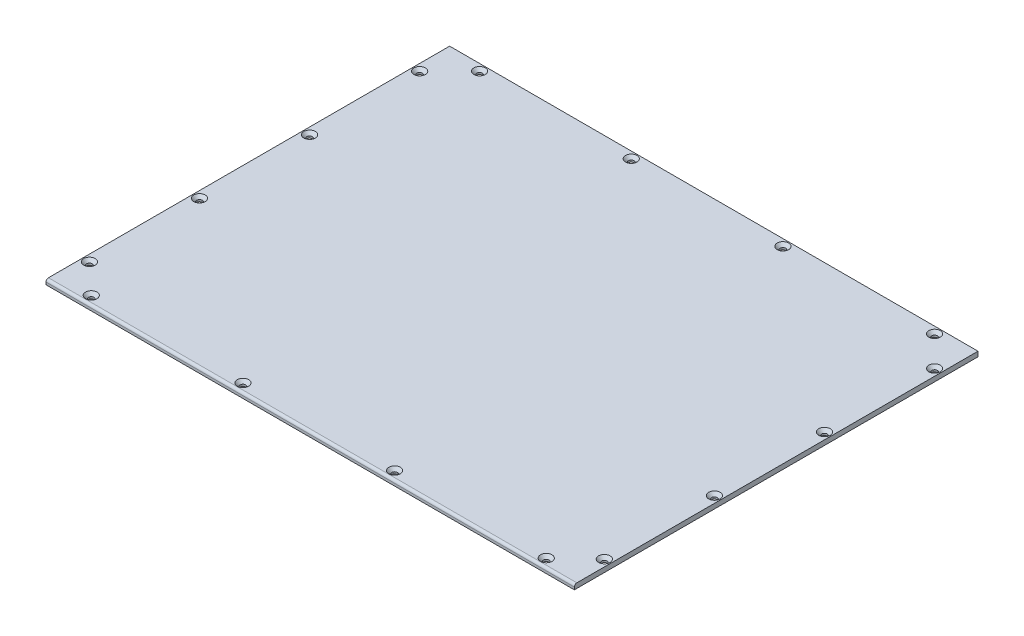
ISO-10303-21;
HEADER;
FILE_DESCRIPTION(('STEP AP214'),'2;1');
FILE_NAME('part.step','',(''),(''),'','','');
FILE_SCHEMA(('AUTOMOTIVE_DESIGN { 1 0 10303 214 1 1 1 1 }'));
ENDSEC;
DATA;
#1=APPLICATION_CONTEXT('core data for automotive mechanical design processes');
#2=APPLICATION_PROTOCOL_DEFINITION('international standard','automotive_design',2000,#1);
#3=PRODUCT_CONTEXT('',#1,'mechanical');
#4=PRODUCT('Part','Part','',(#3));
#5=PRODUCT_RELATED_PRODUCT_CATEGORY('part','',(#4));
#6=PRODUCT_DEFINITION_FORMATION('','',#4);
#7=PRODUCT_DEFINITION_CONTEXT('part definition',#1,'design');
#8=PRODUCT_DEFINITION('design','',#6,#7);
#9=PRODUCT_DEFINITION_SHAPE('','',#8);
#10=(LENGTH_UNIT() NAMED_UNIT(*) SI_UNIT(.MILLI.,.METRE.));
#11=(NAMED_UNIT(*) PLANE_ANGLE_UNIT() SI_UNIT($,.RADIAN.));
#12=(NAMED_UNIT(*) SI_UNIT($,.STERADIAN.) SOLID_ANGLE_UNIT());
#13=UNCERTAINTY_MEASURE_WITH_UNIT(LENGTH_MEASURE(1.E-05),#10,'distance_accuracy_value','');
#14=(GEOMETRIC_REPRESENTATION_CONTEXT(3) GLOBAL_UNCERTAINTY_ASSIGNED_CONTEXT((#13)) GLOBAL_UNIT_ASSIGNED_CONTEXT((#10,
#11,#12)) REPRESENTATION_CONTEXT('',''));
#15=CARTESIAN_POINT('',(0.,0.,0.));
#16=DIRECTION('',(0.,0.,1.));
#17=DIRECTION('',(1.,0.,0.));
#18=AXIS2_PLACEMENT_3D('',#15,#16,#17);
#19=CARTESIAN_POINT('',(0.,0.,0.));
#20=DIRECTION('',(0.,-1.,0.));
#21=DIRECTION('',(0.,0.,-1.));
#22=AXIS2_PLACEMENT_3D('',#19,#20,#21);
#23=PLANE('',#22);
#24=CARTESIAN_POINT('',(30.,0.,-324.5));
#25=DIRECTION('',(0.,1.,0.));
#26=DIRECTION('',(0.,0.,1.));
#27=AXIS2_PLACEMENT_3D('',#24,#25,#26);
#28=CIRCLE('',#27,2.25);
#29=CARTESIAN_POINT('',(30.,0.,-322.25));
#30=VERTEX_POINT('',#29);
#31=EDGE_CURVE('E261',#30,#30,#28,.T.);
#32=ORIENTED_EDGE('',*,*,#31,.T.);
#33=EDGE_LOOP('',(#32));
#34=FACE_BOUND('',#33,.T.);
#35=CARTESIAN_POINT('',(154.,0.,-324.5));
#36=DIRECTION('',(0.,1.,0.));
#37=DIRECTION('',(0.,0.,1.));
#38=AXIS2_PLACEMENT_3D('',#35,#36,#37);
#39=CIRCLE('',#38,2.25);
#40=CARTESIAN_POINT('',(154.,0.,-322.25));
#41=VERTEX_POINT('',#40);
#42=EDGE_CURVE('E252',#41,#41,#39,.T.);
#43=ORIENTED_EDGE('',*,*,#42,.T.);
#44=EDGE_LOOP('',(#43));
#45=FACE_BOUND('',#44,.T.);
#46=DIRECTION('',(0.,0.,1.));
#47=VECTOR('',#46,1.);
#48=CARTESIAN_POINT('',(0.,0.,0.));
#49=LINE('',#48,#47);
#50=CARTESIAN_POINT('',(0.,0.,-330.));
#51=VERTEX_POINT('',#50);
#52=CARTESIAN_POINT('',(0.,0.,0.));
#53=VERTEX_POINT('',#52);
#54=EDGE_CURVE('E104',#51,#53,#49,.T.);
#55=ORIENTED_EDGE('',*,*,#54,.F.);
#56=DIRECTION('',(-1.,0.,0.));
#57=VECTOR('',#56,1.);
#58=CARTESIAN_POINT('',(0.,0.,-330.));
#59=LINE('',#58,#57);
#60=CARTESIAN_POINT('',(432.,0.,-330.));
#61=VERTEX_POINT('',#60);
#62=EDGE_CURVE('E112',#61,#51,#59,.T.);
#63=ORIENTED_EDGE('',*,*,#62,.F.);
#64=DIRECTION('',(0.,0.,-1.));
#65=VECTOR('',#64,1.);
#66=CARTESIAN_POINT('',(432.,0.,0.));
#67=LINE('',#66,#65);
#68=CARTESIAN_POINT('',(432.,0.,0.));
#69=VERTEX_POINT('',#68);
#70=EDGE_CURVE('E91',#69,#61,#67,.T.);
#71=ORIENTED_EDGE('',*,*,#70,.F.);
#72=DIRECTION('',(1.,0.,0.));
#73=VECTOR('',#72,1.);
#74=CARTESIAN_POINT('',(0.,0.,0.));
#75=LINE('',#74,#73);
#76=EDGE_CURVE('E107',#53,#69,#75,.T.);
#77=ORIENTED_EDGE('',*,*,#76,.F.);
#78=EDGE_LOOP('',(#55,#63,#71,#77));
#79=FACE_BOUND('',#78,.T.);
#80=CARTESIAN_POINT('',(5.5,0.,-300.));
#81=DIRECTION('',(0.,1.,0.));
#82=DIRECTION('',(0.,0.,1.));
#83=AXIS2_PLACEMENT_3D('',#80,#81,#82);
#84=CIRCLE('',#83,2.25);
#85=CARTESIAN_POINT('',(5.5,0.,-297.75));
#86=VERTEX_POINT('',#85);
#87=EDGE_CURVE('E108',#86,#86,#84,.T.);
#88=ORIENTED_EDGE('',*,*,#87,.T.);
#89=EDGE_LOOP('',(#88));
#90=FACE_BOUND('',#89,.T.);
#91=CARTESIAN_POINT('',(5.5,0.,-210.));
#92=DIRECTION('',(0.,1.,0.));
#93=DIRECTION('',(0.,0.,1.));
#94=AXIS2_PLACEMENT_3D('',#91,#92,#93);
#95=CIRCLE('',#94,2.25);
#96=CARTESIAN_POINT('',(5.5,0.,-207.75));
#97=VERTEX_POINT('',#96);
#98=EDGE_CURVE('E135',#97,#97,#95,.T.);
#99=ORIENTED_EDGE('',*,*,#98,.T.);
#100=EDGE_LOOP('',(#99));
#101=FACE_BOUND('',#100,.T.);
#102=CARTESIAN_POINT('',(5.5,0.,-120.));
#103=DIRECTION('',(0.,1.,0.));
#104=DIRECTION('',(0.,0.,1.));
#105=AXIS2_PLACEMENT_3D('',#102,#103,#104);
#106=CIRCLE('',#105,2.25);
#107=CARTESIAN_POINT('',(5.5,0.,-117.75));
#108=VERTEX_POINT('',#107);
#109=EDGE_CURVE('E144',#108,#108,#106,.T.);
#110=ORIENTED_EDGE('',*,*,#109,.T.);
#111=EDGE_LOOP('',(#110));
#112=FACE_BOUND('',#111,.T.);
#113=CARTESIAN_POINT('',(5.5,0.,-30.0000000000001));
#114=DIRECTION('',(0.,1.,0.));
#115=DIRECTION('',(0.,0.,1.));
#116=AXIS2_PLACEMENT_3D('',#113,#114,#115);
#117=CIRCLE('',#116,2.25);
#118=CARTESIAN_POINT('',(5.5,0.,-27.7500000000001));
#119=VERTEX_POINT('',#118);
#120=EDGE_CURVE('E153',#119,#119,#117,.T.);
#121=ORIENTED_EDGE('',*,*,#120,.T.);
#122=EDGE_LOOP('',(#121));
#123=FACE_BOUND('',#122,.T.);
#124=CARTESIAN_POINT('',(30.,0.,-7.));
#125=DIRECTION('',(0.,1.,0.));
#126=DIRECTION('',(0.,0.,1.));
#127=AXIS2_PLACEMENT_3D('',#124,#125,#126);
#128=CIRCLE('',#127,2.25);
#129=CARTESIAN_POINT('',(30.,0.,-4.75));
#130=VERTEX_POINT('',#129);
#131=EDGE_CURVE('E162',#130,#130,#128,.T.);
#132=ORIENTED_EDGE('',*,*,#131,.T.);
#133=EDGE_LOOP('',(#132));
#134=FACE_BOUND('',#133,.T.);
#135=CARTESIAN_POINT('',(154.,0.,-7.));
#136=DIRECTION('',(0.,1.,0.));
#137=DIRECTION('',(0.,0.,1.));
#138=AXIS2_PLACEMENT_3D('',#135,#136,#137);
#139=CIRCLE('',#138,2.25);
#140=CARTESIAN_POINT('',(154.,0.,-4.75));
#141=VERTEX_POINT('',#140);
#142=EDGE_CURVE('E171',#141,#141,#139,.T.);
#143=ORIENTED_EDGE('',*,*,#142,.T.);
#144=EDGE_LOOP('',(#143));
#145=FACE_BOUND('',#144,.T.);
#146=CARTESIAN_POINT('',(278.,0.,-7.));
#147=DIRECTION('',(0.,1.,0.));
#148=DIRECTION('',(0.,0.,1.));
#149=AXIS2_PLACEMENT_3D('',#146,#147,#148);
#150=CIRCLE('',#149,2.24999999999997);
#151=CARTESIAN_POINT('',(278.,0.,-4.75000000000003));
#152=VERTEX_POINT('',#151);
#153=EDGE_CURVE('E180',#152,#152,#150,.T.);
#154=ORIENTED_EDGE('',*,*,#153,.T.);
#155=EDGE_LOOP('',(#154));
#156=FACE_BOUND('',#155,.T.);
#157=CARTESIAN_POINT('',(402.,0.,-7.));
#158=DIRECTION('',(0.,1.,0.));
#159=DIRECTION('',(0.,0.,1.));
#160=AXIS2_PLACEMENT_3D('',#157,#158,#159);
#161=CIRCLE('',#160,2.24999999999997);
#162=CARTESIAN_POINT('',(402.,0.,-4.75000000000003));
#163=VERTEX_POINT('',#162);
#164=EDGE_CURVE('E189',#163,#163,#161,.T.);
#165=ORIENTED_EDGE('',*,*,#164,.T.);
#166=EDGE_LOOP('',(#165));
#167=FACE_BOUND('',#166,.T.);
#168=CARTESIAN_POINT('',(426.5,0.,-30.0000000000001));
#169=DIRECTION('',(0.,1.,0.));
#170=DIRECTION('',(0.,0.,1.));
#171=AXIS2_PLACEMENT_3D('',#168,#169,#170);
#172=CIRCLE('',#171,2.24999999999997);
#173=CARTESIAN_POINT('',(426.5,0.,-27.7500000000001));
#174=VERTEX_POINT('',#173);
#175=EDGE_CURVE('E198',#174,#174,#172,.T.);
#176=ORIENTED_EDGE('',*,*,#175,.T.);
#177=EDGE_LOOP('',(#176));
#178=FACE_BOUND('',#177,.T.);
#179=CARTESIAN_POINT('',(426.5,0.,-120.));
#180=DIRECTION('',(0.,1.,0.));
#181=DIRECTION('',(0.,0.,1.));
#182=AXIS2_PLACEMENT_3D('',#179,#180,#181);
#183=CIRCLE('',#182,2.24999999999997);
#184=CARTESIAN_POINT('',(426.5,0.,-117.75));
#185=VERTEX_POINT('',#184);
#186=EDGE_CURVE('E207',#185,#185,#183,.T.);
#187=ORIENTED_EDGE('',*,*,#186,.T.);
#188=EDGE_LOOP('',(#187));
#189=FACE_BOUND('',#188,.T.);
#190=CARTESIAN_POINT('',(426.5,0.,-210.));
#191=DIRECTION('',(0.,1.,0.));
#192=DIRECTION('',(0.,0.,1.));
#193=AXIS2_PLACEMENT_3D('',#190,#191,#192);
#194=CIRCLE('',#193,2.24999999999997);
#195=CARTESIAN_POINT('',(426.5,0.,-207.75));
#196=VERTEX_POINT('',#195);
#197=EDGE_CURVE('E216',#196,#196,#194,.T.);
#198=ORIENTED_EDGE('',*,*,#197,.T.);
#199=EDGE_LOOP('',(#198));
#200=FACE_BOUND('',#199,.T.);
#201=CARTESIAN_POINT('',(426.5,0.,-300.));
#202=DIRECTION('',(0.,1.,0.));
#203=DIRECTION('',(0.,0.,1.));
#204=AXIS2_PLACEMENT_3D('',#201,#202,#203);
#205=CIRCLE('',#204,2.24999999999997);
#206=CARTESIAN_POINT('',(426.5,0.,-297.75));
#207=VERTEX_POINT('',#206);
#208=EDGE_CURVE('E225',#207,#207,#205,.T.);
#209=ORIENTED_EDGE('',*,*,#208,.T.);
#210=EDGE_LOOP('',(#209));
#211=FACE_BOUND('',#210,.T.);
#212=CARTESIAN_POINT('',(402.,0.,-324.5));
#213=DIRECTION('',(0.,1.,0.));
#214=DIRECTION('',(0.,0.,1.));
#215=AXIS2_PLACEMENT_3D('',#212,#213,#214);
#216=CIRCLE('',#215,2.24999999999997);
#217=CARTESIAN_POINT('',(402.,0.,-322.25));
#218=VERTEX_POINT('',#217);
#219=EDGE_CURVE('E234',#218,#218,#216,.T.);
#220=ORIENTED_EDGE('',*,*,#219,.T.);
#221=EDGE_LOOP('',(#220));
#222=FACE_BOUND('',#221,.T.);
#223=CARTESIAN_POINT('',(278.,0.,-324.5));
#224=DIRECTION('',(0.,1.,0.));
#225=DIRECTION('',(0.,0.,1.));
#226=AXIS2_PLACEMENT_3D('',#223,#224,#225);
#227=CIRCLE('',#226,2.24999999999997);
#228=CARTESIAN_POINT('',(278.,0.,-322.25));
#229=VERTEX_POINT('',#228);
#230=EDGE_CURVE('E243',#229,#229,#227,.T.);
#231=ORIENTED_EDGE('',*,*,#230,.T.);
#232=EDGE_LOOP('',(#231));
#233=FACE_BOUND('',#232,.T.);
#234=ADVANCED_FACE('F32',(#34,#45,#79,#90,#101,#112,#123,#134,#145,#156,#167,#178,#189,#200,
#211,#222,#233),#23,.T.);
#235=CARTESIAN_POINT('',(0.,4.,0.));
#236=DIRECTION('',(1.,0.,0.));
#237=DIRECTION('',(0.,0.,-1.));
#238=AXIS2_PLACEMENT_3D('',#235,#236,#237);
#239=PLANE('',#238);
#240=DIRECTION('',(0.,-1.,0.));
#241=VECTOR('',#240,1.);
#242=CARTESIAN_POINT('',(0.,4.,0.));
#243=LINE('',#242,#241);
#244=CARTESIAN_POINT('',(0.,2.,0.));
#245=VERTEX_POINT('',#244);
#246=EDGE_CURVE('E115',#245,#53,#243,.T.);
#247=ORIENTED_EDGE('',*,*,#246,.F.);
#248=CARTESIAN_POINT('',(0.,2.,-2.));
#249=DIRECTION('',(1.,0.,0.));
#250=DIRECTION('',(0.,0.,-1.));
#251=AXIS2_PLACEMENT_3D('',#248,#249,#250);
#252=CIRCLE('',#251,2.);
#253=CARTESIAN_POINT('',(0.,4.,-2.));
#254=VERTEX_POINT('',#253);
#255=EDGE_CURVE('E11',#245,#254,#252,.F.);
#256=ORIENTED_EDGE('',*,*,#255,.T.);
#257=DIRECTION('',(0.,0.,1.));
#258=VECTOR('',#257,1.);
#259=CARTESIAN_POINT('',(0.,4.,0.));
#260=LINE('',#259,#258);
#261=CARTESIAN_POINT('',(0.,4.,-330.));
#262=VERTEX_POINT('',#261);
#263=EDGE_CURVE('E85',#262,#254,#260,.T.);
#264=ORIENTED_EDGE('',*,*,#263,.F.);
#265=DIRECTION('',(0.,-1.,0.));
#266=VECTOR('',#265,1.);
#267=CARTESIAN_POINT('',(0.,4.,-330.));
#268=LINE('',#267,#266);
#269=EDGE_CURVE('E95',#262,#51,#268,.T.);
#270=ORIENTED_EDGE('',*,*,#269,.T.);
#271=ORIENTED_EDGE('',*,*,#54,.T.);
#272=EDGE_LOOP('',(#247,#256,#264,#270,#271));
#273=FACE_BOUND('',#272,.T.);
#274=ADVANCED_FACE('F125',(#273),#239,.F.);
#275=CARTESIAN_POINT('',(0.,4.,0.));
#276=DIRECTION('',(0.,0.,-1.));
#277=DIRECTION('',(-1.,0.,0.));
#278=AXIS2_PLACEMENT_3D('',#275,#276,#277);
#279=PLANE('',#278);
#280=DIRECTION('',(0.,-1.,0.));
#281=VECTOR('',#280,1.);
#282=CARTESIAN_POINT('',(432.,4.,0.));
#283=LINE('',#282,#281);
#284=CARTESIAN_POINT('',(432.,2.,0.));
#285=VERTEX_POINT('',#284);
#286=EDGE_CURVE('E94',#285,#69,#283,.T.);
#287=ORIENTED_EDGE('',*,*,#286,.F.);
#288=DIRECTION('',(1.,0.,0.));
#289=VECTOR('',#288,1.);
#290=CARTESIAN_POINT('',(0.,2.,0.));
#291=LINE('',#290,#289);
#292=EDGE_CURVE('E40',#285,#245,#291,.F.);
#293=ORIENTED_EDGE('',*,*,#292,.T.);
#294=ORIENTED_EDGE('',*,*,#246,.T.);
#295=ORIENTED_EDGE('',*,*,#76,.T.);
#296=EDGE_LOOP('',(#287,#293,#294,#295));
#297=FACE_BOUND('',#296,.T.);
#298=ADVANCED_FACE('F119',(#297),#279,.F.);
#299=CARTESIAN_POINT('',(432.,4.,0.));
#300=DIRECTION('',(-1.,0.,0.));
#301=DIRECTION('',(0.,0.,1.));
#302=AXIS2_PLACEMENT_3D('',#299,#300,#301);
#303=PLANE('',#302);
#304=DIRECTION('',(0.,0.,-1.));
#305=VECTOR('',#304,1.);
#306=CARTESIAN_POINT('',(432.,4.,0.));
#307=LINE('',#306,#305);
#308=CARTESIAN_POINT('',(432.,4.,-2.));
#309=VERTEX_POINT('',#308);
#310=CARTESIAN_POINT('',(432.,4.,-330.));
#311=VERTEX_POINT('',#310);
#312=EDGE_CURVE('E76',#309,#311,#307,.T.);
#313=ORIENTED_EDGE('',*,*,#312,.F.);
#314=CARTESIAN_POINT('',(432.,2.,-2.));
#315=DIRECTION('',(-1.,0.,0.));
#316=DIRECTION('',(0.,0.,1.));
#317=AXIS2_PLACEMENT_3D('',#314,#315,#316);
#318=CIRCLE('',#317,2.);
#319=EDGE_CURVE('E54',#309,#285,#318,.F.);
#320=ORIENTED_EDGE('',*,*,#319,.T.);
#321=ORIENTED_EDGE('',*,*,#286,.T.);
#322=ORIENTED_EDGE('',*,*,#70,.T.);
#323=DIRECTION('',(0.,-1.,0.));
#324=VECTOR('',#323,1.);
#325=CARTESIAN_POINT('',(432.,4.,-330.));
#326=LINE('',#325,#324);
#327=EDGE_CURVE('E88',#311,#61,#326,.T.);
#328=ORIENTED_EDGE('',*,*,#327,.F.);
#329=EDGE_LOOP('',(#313,#320,#321,#322,#328));
#330=FACE_BOUND('',#329,.T.);
#331=ADVANCED_FACE('F89',(#330),#303,.F.);
#332=CARTESIAN_POINT('',(0.,4.,-330.));
#333=DIRECTION('',(0.,0.,1.));
#334=DIRECTION('',(1.,0.,0.));
#335=AXIS2_PLACEMENT_3D('',#332,#333,#334);
#336=PLANE('',#335);
#337=ORIENTED_EDGE('',*,*,#62,.T.);
#338=ORIENTED_EDGE('',*,*,#269,.F.);
#339=DIRECTION('',(-1.,0.,0.));
#340=VECTOR('',#339,1.);
#341=CARTESIAN_POINT('',(0.,4.,-330.));
#342=LINE('',#341,#340);
#343=EDGE_CURVE('E81',#311,#262,#342,.T.);
#344=ORIENTED_EDGE('',*,*,#343,.F.);
#345=ORIENTED_EDGE('',*,*,#327,.T.);
#346=EDGE_LOOP('',(#337,#338,#344,#345));
#347=FACE_BOUND('',#346,.T.);
#348=ADVANCED_FACE('F97',(#347),#336,.F.);
#349=CARTESIAN_POINT('',(0.,4.,0.));
#350=DIRECTION('',(0.,-1.,0.));
#351=DIRECTION('',(0.,0.,-1.));
#352=AXIS2_PLACEMENT_3D('',#349,#350,#351);
#353=PLANE('',#352);
#354=CARTESIAN_POINT('',(30.,4.,-324.5));
#355=DIRECTION('',(0.,1.,0.));
#356=DIRECTION('',(0.,0.,1.));
#357=AXIS2_PLACEMENT_3D('',#354,#355,#356);
#358=CIRCLE('',#357,4.7);
#359=CARTESIAN_POINT('',(30.,4.,-319.8));
#360=VERTEX_POINT('',#359);
#361=EDGE_CURVE('E267',#360,#360,#358,.T.);
#362=ORIENTED_EDGE('',*,*,#361,.F.);
#363=EDGE_LOOP('',(#362));
#364=FACE_BOUND('',#363,.T.);
#365=CARTESIAN_POINT('',(154.,4.,-324.5));
#366=DIRECTION('',(0.,1.,0.));
#367=DIRECTION('',(0.,0.,1.));
#368=AXIS2_PLACEMENT_3D('',#365,#366,#367);
#369=CIRCLE('',#368,4.70000000000001);
#370=CARTESIAN_POINT('',(154.,4.,-319.8));
#371=VERTEX_POINT('',#370);
#372=EDGE_CURVE('E258',#371,#371,#369,.T.);
#373=ORIENTED_EDGE('',*,*,#372,.F.);
#374=EDGE_LOOP('',(#373));
#375=FACE_BOUND('',#374,.T.);
#376=CARTESIAN_POINT('',(278.,4.,-324.5));
#377=DIRECTION('',(0.,1.,0.));
#378=DIRECTION('',(0.,0.,1.));
#379=AXIS2_PLACEMENT_3D('',#376,#377,#378);
#380=CIRCLE('',#379,4.69999999999998);
#381=CARTESIAN_POINT('',(278.,4.,-319.8));
#382=VERTEX_POINT('',#381);
#383=EDGE_CURVE('E249',#382,#382,#380,.T.);
#384=ORIENTED_EDGE('',*,*,#383,.F.);
#385=EDGE_LOOP('',(#384));
#386=FACE_BOUND('',#385,.T.);
#387=CARTESIAN_POINT('',(402.,4.,-324.5));
#388=DIRECTION('',(0.,1.,0.));
#389=DIRECTION('',(0.,0.,1.));
#390=AXIS2_PLACEMENT_3D('',#387,#388,#389);
#391=CIRCLE('',#390,4.69999999999998);
#392=CARTESIAN_POINT('',(402.,4.,-319.8));
#393=VERTEX_POINT('',#392);
#394=EDGE_CURVE('E240',#393,#393,#391,.T.);
#395=ORIENTED_EDGE('',*,*,#394,.F.);
#396=EDGE_LOOP('',(#395));
#397=FACE_BOUND('',#396,.T.);
#398=CARTESIAN_POINT('',(426.5,4.,-300.));
#399=DIRECTION('',(0.,1.,0.));
#400=DIRECTION('',(0.,0.,1.));
#401=AXIS2_PLACEMENT_3D('',#398,#399,#400);
#402=CIRCLE('',#401,4.69999999999998);
#403=CARTESIAN_POINT('',(426.5,4.,-295.3));
#404=VERTEX_POINT('',#403);
#405=EDGE_CURVE('E231',#404,#404,#402,.T.);
#406=ORIENTED_EDGE('',*,*,#405,.F.);
#407=EDGE_LOOP('',(#406));
#408=FACE_BOUND('',#407,.T.);
#409=CARTESIAN_POINT('',(426.5,4.,-210.));
#410=DIRECTION('',(0.,1.,0.));
#411=DIRECTION('',(0.,0.,1.));
#412=AXIS2_PLACEMENT_3D('',#409,#410,#411);
#413=CIRCLE('',#412,4.69999999999998);
#414=CARTESIAN_POINT('',(426.5,4.,-205.3));
#415=VERTEX_POINT('',#414);
#416=EDGE_CURVE('E222',#415,#415,#413,.T.);
#417=ORIENTED_EDGE('',*,*,#416,.F.);
#418=EDGE_LOOP('',(#417));
#419=FACE_BOUND('',#418,.T.);
#420=CARTESIAN_POINT('',(426.5,4.,-120.));
#421=DIRECTION('',(0.,1.,0.));
#422=DIRECTION('',(0.,0.,1.));
#423=AXIS2_PLACEMENT_3D('',#420,#421,#422);
#424=CIRCLE('',#423,4.69999999999998);
#425=CARTESIAN_POINT('',(426.5,4.,-115.3));
#426=VERTEX_POINT('',#425);
#427=EDGE_CURVE('E213',#426,#426,#424,.T.);
#428=ORIENTED_EDGE('',*,*,#427,.F.);
#429=EDGE_LOOP('',(#428));
#430=FACE_BOUND('',#429,.T.);
#431=CARTESIAN_POINT('',(426.5,4.,-30.0000000000001));
#432=DIRECTION('',(0.,1.,0.));
#433=DIRECTION('',(0.,0.,1.));
#434=AXIS2_PLACEMENT_3D('',#431,#432,#433);
#435=CIRCLE('',#434,4.69999999999998);
#436=CARTESIAN_POINT('',(426.5,4.,-25.3000000000001));
#437=VERTEX_POINT('',#436);
#438=EDGE_CURVE('E204',#437,#437,#435,.T.);
#439=ORIENTED_EDGE('',*,*,#438,.F.);
#440=EDGE_LOOP('',(#439));
#441=FACE_BOUND('',#440,.T.);
#442=CARTESIAN_POINT('',(402.,4.,-7.));
#443=DIRECTION('',(0.,1.,0.));
#444=DIRECTION('',(0.,0.,1.));
#445=AXIS2_PLACEMENT_3D('',#442,#443,#444);
#446=CIRCLE('',#445,4.69999999999998);
#447=CARTESIAN_POINT('',(402.,4.,-2.30000000000002));
#448=VERTEX_POINT('',#447);
#449=EDGE_CURVE('E195',#448,#448,#446,.T.);
#450=ORIENTED_EDGE('',*,*,#449,.F.);
#451=EDGE_LOOP('',(#450));
#452=FACE_BOUND('',#451,.T.);
#453=CARTESIAN_POINT('',(278.,4.,-7.));
#454=DIRECTION('',(0.,1.,0.));
#455=DIRECTION('',(0.,0.,1.));
#456=AXIS2_PLACEMENT_3D('',#453,#454,#455);
#457=CIRCLE('',#456,4.69999999999998);
#458=CARTESIAN_POINT('',(278.,4.,-2.30000000000002));
#459=VERTEX_POINT('',#458);
#460=EDGE_CURVE('E186',#459,#459,#457,.T.);
#461=ORIENTED_EDGE('',*,*,#460,.F.);
#462=EDGE_LOOP('',(#461));
#463=FACE_BOUND('',#462,.T.);
#464=CARTESIAN_POINT('',(154.,4.,-7.));
#465=DIRECTION('',(0.,1.,0.));
#466=DIRECTION('',(0.,0.,1.));
#467=AXIS2_PLACEMENT_3D('',#464,#465,#466);
#468=CIRCLE('',#467,4.70000000000001);
#469=CARTESIAN_POINT('',(154.,4.,-2.29999999999999));
#470=VERTEX_POINT('',#469);
#471=EDGE_CURVE('E177',#470,#470,#468,.T.);
#472=ORIENTED_EDGE('',*,*,#471,.F.);
#473=EDGE_LOOP('',(#472));
#474=FACE_BOUND('',#473,.T.);
#475=CARTESIAN_POINT('',(30.,4.,-7.));
#476=DIRECTION('',(0.,1.,0.));
#477=DIRECTION('',(0.,0.,1.));
#478=AXIS2_PLACEMENT_3D('',#475,#476,#477);
#479=CIRCLE('',#478,4.7);
#480=CARTESIAN_POINT('',(30.,4.,-2.3));
#481=VERTEX_POINT('',#480);
#482=EDGE_CURVE('E168',#481,#481,#479,.T.);
#483=ORIENTED_EDGE('',*,*,#482,.F.);
#484=EDGE_LOOP('',(#483));
#485=FACE_BOUND('',#484,.T.);
#486=CARTESIAN_POINT('',(5.5,4.,-30.0000000000001));
#487=DIRECTION('',(0.,1.,0.));
#488=DIRECTION('',(0.,0.,1.));
#489=AXIS2_PLACEMENT_3D('',#486,#487,#488);
#490=CIRCLE('',#489,4.7);
#491=CARTESIAN_POINT('',(5.5,4.,-25.3000000000001));
#492=VERTEX_POINT('',#491);
#493=EDGE_CURVE('E159',#492,#492,#490,.T.);
#494=ORIENTED_EDGE('',*,*,#493,.F.);
#495=EDGE_LOOP('',(#494));
#496=FACE_BOUND('',#495,.T.);
#497=CARTESIAN_POINT('',(5.5,4.,-120.));
#498=DIRECTION('',(0.,1.,0.));
#499=DIRECTION('',(0.,0.,1.));
#500=AXIS2_PLACEMENT_3D('',#497,#498,#499);
#501=CIRCLE('',#500,4.7);
#502=CARTESIAN_POINT('',(5.5,4.,-115.3));
#503=VERTEX_POINT('',#502);
#504=EDGE_CURVE('E150',#503,#503,#501,.T.);
#505=ORIENTED_EDGE('',*,*,#504,.F.);
#506=EDGE_LOOP('',(#505));
#507=FACE_BOUND('',#506,.T.);
#508=CARTESIAN_POINT('',(5.5,4.,-210.));
#509=DIRECTION('',(0.,1.,0.));
#510=DIRECTION('',(0.,0.,1.));
#511=AXIS2_PLACEMENT_3D('',#508,#509,#510);
#512=CIRCLE('',#511,4.7);
#513=CARTESIAN_POINT('',(5.5,4.,-205.3));
#514=VERTEX_POINT('',#513);
#515=EDGE_CURVE('E141',#514,#514,#512,.T.);
#516=ORIENTED_EDGE('',*,*,#515,.F.);
#517=EDGE_LOOP('',(#516));
#518=FACE_BOUND('',#517,.T.);
#519=CARTESIAN_POINT('',(5.5,4.,-300.));
#520=DIRECTION('',(0.,1.,0.));
#521=DIRECTION('',(0.,0.,1.));
#522=AXIS2_PLACEMENT_3D('',#519,#520,#521);
#523=CIRCLE('',#522,4.7);
#524=CARTESIAN_POINT('',(5.5,4.,-295.3));
#525=VERTEX_POINT('',#524);
#526=EDGE_CURVE('E132',#525,#525,#523,.T.);
#527=ORIENTED_EDGE('',*,*,#526,.F.);
#528=EDGE_LOOP('',(#527));
#529=FACE_BOUND('',#528,.T.);
#530=ORIENTED_EDGE('',*,*,#263,.T.);
#531=DIRECTION('',(1.,0.,0.));
#532=VECTOR('',#531,1.);
#533=CARTESIAN_POINT('',(0.,4.,-2.));
#534=LINE('',#533,#532);
#535=EDGE_CURVE('E84',#254,#309,#534,.T.);
#536=ORIENTED_EDGE('',*,*,#535,.T.);
#537=ORIENTED_EDGE('',*,*,#312,.T.);
#538=ORIENTED_EDGE('',*,*,#343,.T.);
#539=EDGE_LOOP('',(#530,#536,#537,#538));
#540=FACE_BOUND('',#539,.T.);
#541=ADVANCED_FACE('F79',(#364,#375,#386,#397,#408,#419,#430,#441,#452,#463,#474,#485,#496,#507,
#518,#529,#540),#353,.F.);
#542=CARTESIAN_POINT('',(0.,2.,-2.));
#543=DIRECTION('',(1.,0.,0.));
#544=DIRECTION('',(0.,0.,-1.));
#545=AXIS2_PLACEMENT_3D('',#542,#543,#544);
#546=CYLINDRICAL_SURFACE('',#545,2.);
#547=ORIENTED_EDGE('',*,*,#255,.F.);
#548=ORIENTED_EDGE('',*,*,#292,.F.);
#549=ORIENTED_EDGE('',*,*,#319,.F.);
#550=ORIENTED_EDGE('',*,*,#535,.F.);
#551=EDGE_LOOP('',(#547,#548,#549,#550));
#552=FACE_BOUND('',#551,.T.);
#553=ADVANCED_FACE('F34',(#552),#546,.T.);
#554=CARTESIAN_POINT('',(5.5,4.,-300.));
#555=DIRECTION('',(0.,1.,0.));
#556=DIRECTION('',(0.,0.,1.));
#557=AXIS2_PLACEMENT_3D('',#554,#555,#556);
#558=CYLINDRICAL_SURFACE('',#557,2.25);
#559=ORIENTED_EDGE('',*,*,#87,.F.);
#560=EDGE_LOOP('',(#559));
#561=FACE_BOUND('',#560,.T.);
#562=CARTESIAN_POINT('',(5.5,1.55,-300.));
#563=DIRECTION('',(0.,1.,0.));
#564=DIRECTION('',(0.,0.,1.));
#565=AXIS2_PLACEMENT_3D('',#562,#563,#564);
#566=CIRCLE('',#565,2.25);
#567=CARTESIAN_POINT('',(5.5,1.55,-297.75));
#568=VERTEX_POINT('',#567);
#569=EDGE_CURVE('E129',#568,#568,#566,.T.);
#570=ORIENTED_EDGE('',*,*,#569,.T.);
#571=EDGE_LOOP('',(#570));
#572=FACE_BOUND('',#571,.T.);
#573=ADVANCED_FACE('F309',(#561,#572),#558,.F.);
#574=CARTESIAN_POINT('',(5.5,4.,-300.));
#575=DIRECTION('',(0.,1.,0.));
#576=DIRECTION('',(0.,0.,1.));
#577=AXIS2_PLACEMENT_3D('',#574,#575,#576);
#578=CONICAL_SURFACE('',#577,4.7,0.785398163397449);
#579=ORIENTED_EDGE('',*,*,#569,.F.);
#580=EDGE_LOOP('',(#579));
#581=FACE_BOUND('',#580,.T.);
#582=ORIENTED_EDGE('',*,*,#526,.T.);
#583=EDGE_LOOP('',(#582));
#584=FACE_BOUND('',#583,.T.);
#585=ADVANCED_FACE('F306',(#581,#584),#578,.F.);
#586=CARTESIAN_POINT('',(5.5,4.,-210.));
#587=DIRECTION('',(0.,1.,0.));
#588=DIRECTION('',(0.,0.,1.));
#589=AXIS2_PLACEMENT_3D('',#586,#587,#588);
#590=CYLINDRICAL_SURFACE('',#589,2.25);
#591=ORIENTED_EDGE('',*,*,#98,.F.);
#592=EDGE_LOOP('',(#591));
#593=FACE_BOUND('',#592,.T.);
#594=CARTESIAN_POINT('',(5.5,1.55,-210.));
#595=DIRECTION('',(0.,1.,0.));
#596=DIRECTION('',(0.,0.,1.));
#597=AXIS2_PLACEMENT_3D('',#594,#595,#596);
#598=CIRCLE('',#597,2.25);
#599=CARTESIAN_POINT('',(5.5,1.55,-207.75));
#600=VERTEX_POINT('',#599);
#601=EDGE_CURVE('E138',#600,#600,#598,.T.);
#602=ORIENTED_EDGE('',*,*,#601,.T.);
#603=EDGE_LOOP('',(#602));
#604=FACE_BOUND('',#603,.T.);
#605=ADVANCED_FACE('F308',(#593,#604),#590,.F.);
#606=CARTESIAN_POINT('',(5.5,4.,-210.));
#607=DIRECTION('',(0.,1.,0.));
#608=DIRECTION('',(0.,0.,1.));
#609=AXIS2_PLACEMENT_3D('',#606,#607,#608);
#610=CONICAL_SURFACE('',#609,4.7,0.785398163397449);
#611=ORIENTED_EDGE('',*,*,#601,.F.);
#612=EDGE_LOOP('',(#611));
#613=FACE_BOUND('',#612,.T.);
#614=ORIENTED_EDGE('',*,*,#515,.T.);
#615=EDGE_LOOP('',(#614));
#616=FACE_BOUND('',#615,.T.);
#617=ADVANCED_FACE('F316',(#613,#616),#610,.F.);
#618=CARTESIAN_POINT('',(5.5,4.,-120.));
#619=DIRECTION('',(0.,1.,0.));
#620=DIRECTION('',(0.,0.,1.));
#621=AXIS2_PLACEMENT_3D('',#618,#619,#620);
#622=CYLINDRICAL_SURFACE('',#621,2.25);
#623=ORIENTED_EDGE('',*,*,#109,.F.);
#624=EDGE_LOOP('',(#623));
#625=FACE_BOUND('',#624,.T.);
#626=CARTESIAN_POINT('',(5.5,1.55,-120.));
#627=DIRECTION('',(0.,1.,0.));
#628=DIRECTION('',(0.,0.,1.));
#629=AXIS2_PLACEMENT_3D('',#626,#627,#628);
#630=CIRCLE('',#629,2.25);
#631=CARTESIAN_POINT('',(5.5,1.55,-117.75));
#632=VERTEX_POINT('',#631);
#633=EDGE_CURVE('E147',#632,#632,#630,.T.);
#634=ORIENTED_EDGE('',*,*,#633,.T.);
#635=EDGE_LOOP('',(#634));
#636=FACE_BOUND('',#635,.T.);
#637=ADVANCED_FACE('F381',(#625,#636),#622,.F.);
#638=CARTESIAN_POINT('',(5.5,4.,-120.));
#639=DIRECTION('',(0.,1.,0.));
#640=DIRECTION('',(0.,0.,1.));
#641=AXIS2_PLACEMENT_3D('',#638,#639,#640);
#642=CONICAL_SURFACE('',#641,4.7,0.785398163397449);
#643=ORIENTED_EDGE('',*,*,#633,.F.);
#644=EDGE_LOOP('',(#643));
#645=FACE_BOUND('',#644,.T.);
#646=ORIENTED_EDGE('',*,*,#504,.T.);
#647=EDGE_LOOP('',(#646));
#648=FACE_BOUND('',#647,.T.);
#649=ADVANCED_FACE('F391',(#645,#648),#642,.F.);
#650=CARTESIAN_POINT('',(5.5,4.,-30.0000000000001));
#651=DIRECTION('',(0.,1.,0.));
#652=DIRECTION('',(0.,0.,1.));
#653=AXIS2_PLACEMENT_3D('',#650,#651,#652);
#654=CYLINDRICAL_SURFACE('',#653,2.25);
#655=ORIENTED_EDGE('',*,*,#120,.F.);
#656=EDGE_LOOP('',(#655));
#657=FACE_BOUND('',#656,.T.);
#658=CARTESIAN_POINT('',(5.5,1.55,-30.0000000000001));
#659=DIRECTION('',(0.,1.,0.));
#660=DIRECTION('',(0.,0.,1.));
#661=AXIS2_PLACEMENT_3D('',#658,#659,#660);
#662=CIRCLE('',#661,2.25);
#663=CARTESIAN_POINT('',(5.5,1.55,-27.7500000000001));
#664=VERTEX_POINT('',#663);
#665=EDGE_CURVE('E156',#664,#664,#662,.T.);
#666=ORIENTED_EDGE('',*,*,#665,.T.);
#667=EDGE_LOOP('',(#666));
#668=FACE_BOUND('',#667,.T.);
#669=ADVANCED_FACE('F401',(#657,#668),#654,.F.);
#670=CARTESIAN_POINT('',(5.5,4.,-30.0000000000001));
#671=DIRECTION('',(0.,1.,0.));
#672=DIRECTION('',(0.,0.,1.));
#673=AXIS2_PLACEMENT_3D('',#670,#671,#672);
#674=CONICAL_SURFACE('',#673,4.7,0.785398163397449);
#675=ORIENTED_EDGE('',*,*,#665,.F.);
#676=EDGE_LOOP('',(#675));
#677=FACE_BOUND('',#676,.T.);
#678=ORIENTED_EDGE('',*,*,#493,.T.);
#679=EDGE_LOOP('',(#678));
#680=FACE_BOUND('',#679,.T.);
#681=ADVANCED_FACE('F411',(#677,#680),#674,.F.);
#682=CARTESIAN_POINT('',(30.,4.,-7.));
#683=DIRECTION('',(0.,1.,0.));
#684=DIRECTION('',(0.,0.,1.));
#685=AXIS2_PLACEMENT_3D('',#682,#683,#684);
#686=CYLINDRICAL_SURFACE('',#685,2.25);
#687=ORIENTED_EDGE('',*,*,#131,.F.);
#688=EDGE_LOOP('',(#687));
#689=FACE_BOUND('',#688,.T.);
#690=CARTESIAN_POINT('',(30.,1.55,-7.));
#691=DIRECTION('',(0.,1.,0.));
#692=DIRECTION('',(0.,0.,1.));
#693=AXIS2_PLACEMENT_3D('',#690,#691,#692);
#694=CIRCLE('',#693,2.25);
#695=CARTESIAN_POINT('',(30.,1.55,-4.75));
#696=VERTEX_POINT('',#695);
#697=EDGE_CURVE('E165',#696,#696,#694,.T.);
#698=ORIENTED_EDGE('',*,*,#697,.T.);
#699=EDGE_LOOP('',(#698));
#700=FACE_BOUND('',#699,.T.);
#701=ADVANCED_FACE('F421',(#689,#700),#686,.F.);
#702=CARTESIAN_POINT('',(30.,4.,-7.));
#703=DIRECTION('',(0.,1.,0.));
#704=DIRECTION('',(0.,0.,1.));
#705=AXIS2_PLACEMENT_3D('',#702,#703,#704);
#706=CONICAL_SURFACE('',#705,4.7,0.785398163397449);
#707=ORIENTED_EDGE('',*,*,#697,.F.);
#708=EDGE_LOOP('',(#707));
#709=FACE_BOUND('',#708,.T.);
#710=ORIENTED_EDGE('',*,*,#482,.T.);
#711=EDGE_LOOP('',(#710));
#712=FACE_BOUND('',#711,.T.);
#713=ADVANCED_FACE('F431',(#709,#712),#706,.F.);
#714=CARTESIAN_POINT('',(154.,4.,-7.));
#715=DIRECTION('',(0.,1.,0.));
#716=DIRECTION('',(0.,0.,1.));
#717=AXIS2_PLACEMENT_3D('',#714,#715,#716);
#718=CYLINDRICAL_SURFACE('',#717,2.25);
#719=ORIENTED_EDGE('',*,*,#142,.F.);
#720=EDGE_LOOP('',(#719));
#721=FACE_BOUND('',#720,.T.);
#722=CARTESIAN_POINT('',(154.,1.55,-7.));
#723=DIRECTION('',(0.,1.,0.));
#724=DIRECTION('',(0.,0.,1.));
#725=AXIS2_PLACEMENT_3D('',#722,#723,#724);
#726=CIRCLE('',#725,2.25);
#727=CARTESIAN_POINT('',(154.,1.55,-4.75));
#728=VERTEX_POINT('',#727);
#729=EDGE_CURVE('E174',#728,#728,#726,.T.);
#730=ORIENTED_EDGE('',*,*,#729,.T.);
#731=EDGE_LOOP('',(#730));
#732=FACE_BOUND('',#731,.T.);
#733=ADVANCED_FACE('F441',(#721,#732),#718,.F.);
#734=CARTESIAN_POINT('',(154.,4.,-7.));
#735=DIRECTION('',(0.,1.,0.));
#736=DIRECTION('',(0.,0.,1.));
#737=AXIS2_PLACEMENT_3D('',#734,#735,#736);
#738=CONICAL_SURFACE('',#737,4.70000000000001,0.78539816339745);
#739=ORIENTED_EDGE('',*,*,#729,.F.);
#740=EDGE_LOOP('',(#739));
#741=FACE_BOUND('',#740,.T.);
#742=ORIENTED_EDGE('',*,*,#471,.T.);
#743=EDGE_LOOP('',(#742));
#744=FACE_BOUND('',#743,.T.);
#745=ADVANCED_FACE('F451',(#741,#744),#738,.F.);
#746=CARTESIAN_POINT('',(278.,4.,-7.));
#747=DIRECTION('',(0.,1.,0.));
#748=DIRECTION('',(0.,0.,1.));
#749=AXIS2_PLACEMENT_3D('',#746,#747,#748);
#750=CYLINDRICAL_SURFACE('',#749,2.24999999999997);
#751=ORIENTED_EDGE('',*,*,#153,.F.);
#752=EDGE_LOOP('',(#751));
#753=FACE_BOUND('',#752,.T.);
#754=CARTESIAN_POINT('',(278.,1.55,-7.));
#755=DIRECTION('',(0.,1.,0.));
#756=DIRECTION('',(0.,0.,1.));
#757=AXIS2_PLACEMENT_3D('',#754,#755,#756);
#758=CIRCLE('',#757,2.24999999999997);
#759=CARTESIAN_POINT('',(278.,1.55,-4.75000000000003));
#760=VERTEX_POINT('',#759);
#761=EDGE_CURVE('E183',#760,#760,#758,.T.);
#762=ORIENTED_EDGE('',*,*,#761,.T.);
#763=EDGE_LOOP('',(#762));
#764=FACE_BOUND('',#763,.T.);
#765=ADVANCED_FACE('F461',(#753,#764),#750,.F.);
#766=CARTESIAN_POINT('',(278.,4.,-7.));
#767=DIRECTION('',(0.,1.,0.));
#768=DIRECTION('',(0.,0.,1.));
#769=AXIS2_PLACEMENT_3D('',#766,#767,#768);
#770=CONICAL_SURFACE('',#769,4.69999999999998,0.78539816339745);
#771=ORIENTED_EDGE('',*,*,#761,.F.);
#772=EDGE_LOOP('',(#771));
#773=FACE_BOUND('',#772,.T.);
#774=ORIENTED_EDGE('',*,*,#460,.T.);
#775=EDGE_LOOP('',(#774));
#776=FACE_BOUND('',#775,.T.);
#777=ADVANCED_FACE('F471',(#773,#776),#770,.F.);
#778=CARTESIAN_POINT('',(402.,4.,-7.));
#779=DIRECTION('',(0.,1.,0.));
#780=DIRECTION('',(0.,0.,1.));
#781=AXIS2_PLACEMENT_3D('',#778,#779,#780);
#782=CYLINDRICAL_SURFACE('',#781,2.24999999999997);
#783=ORIENTED_EDGE('',*,*,#164,.F.);
#784=EDGE_LOOP('',(#783));
#785=FACE_BOUND('',#784,.T.);
#786=CARTESIAN_POINT('',(402.,1.55,-7.));
#787=DIRECTION('',(0.,1.,0.));
#788=DIRECTION('',(0.,0.,1.));
#789=AXIS2_PLACEMENT_3D('',#786,#787,#788);
#790=CIRCLE('',#789,2.24999999999997);
#791=CARTESIAN_POINT('',(402.,1.55,-4.75000000000003));
#792=VERTEX_POINT('',#791);
#793=EDGE_CURVE('E192',#792,#792,#790,.T.);
#794=ORIENTED_EDGE('',*,*,#793,.T.);
#795=EDGE_LOOP('',(#794));
#796=FACE_BOUND('',#795,.T.);
#797=ADVANCED_FACE('F481',(#785,#796),#782,.F.);
#798=CARTESIAN_POINT('',(402.,4.,-7.));
#799=DIRECTION('',(0.,1.,0.));
#800=DIRECTION('',(0.,0.,1.));
#801=AXIS2_PLACEMENT_3D('',#798,#799,#800);
#802=CONICAL_SURFACE('',#801,4.69999999999998,0.78539816339745);
#803=ORIENTED_EDGE('',*,*,#793,.F.);
#804=EDGE_LOOP('',(#803));
#805=FACE_BOUND('',#804,.T.);
#806=ORIENTED_EDGE('',*,*,#449,.T.);
#807=EDGE_LOOP('',(#806));
#808=FACE_BOUND('',#807,.T.);
#809=ADVANCED_FACE('F491',(#805,#808),#802,.F.);
#810=CARTESIAN_POINT('',(426.5,4.,-30.0000000000001));
#811=DIRECTION('',(0.,1.,0.));
#812=DIRECTION('',(0.,0.,1.));
#813=AXIS2_PLACEMENT_3D('',#810,#811,#812);
#814=CYLINDRICAL_SURFACE('',#813,2.24999999999997);
#815=ORIENTED_EDGE('',*,*,#175,.F.);
#816=EDGE_LOOP('',(#815));
#817=FACE_BOUND('',#816,.T.);
#818=CARTESIAN_POINT('',(426.5,1.55,-30.0000000000001));
#819=DIRECTION('',(0.,1.,0.));
#820=DIRECTION('',(0.,0.,1.));
#821=AXIS2_PLACEMENT_3D('',#818,#819,#820);
#822=CIRCLE('',#821,2.24999999999997);
#823=CARTESIAN_POINT('',(426.5,1.55,-27.7500000000001));
#824=VERTEX_POINT('',#823);
#825=EDGE_CURVE('E201',#824,#824,#822,.T.);
#826=ORIENTED_EDGE('',*,*,#825,.T.);
#827=EDGE_LOOP('',(#826));
#828=FACE_BOUND('',#827,.T.);
#829=ADVANCED_FACE('F501',(#817,#828),#814,.F.);
#830=CARTESIAN_POINT('',(426.5,4.,-30.0000000000001));
#831=DIRECTION('',(0.,1.,0.));
#832=DIRECTION('',(0.,0.,1.));
#833=AXIS2_PLACEMENT_3D('',#830,#831,#832);
#834=CONICAL_SURFACE('',#833,4.69999999999998,0.78539816339745);
#835=ORIENTED_EDGE('',*,*,#825,.F.);
#836=EDGE_LOOP('',(#835));
#837=FACE_BOUND('',#836,.T.);
#838=ORIENTED_EDGE('',*,*,#438,.T.);
#839=EDGE_LOOP('',(#838));
#840=FACE_BOUND('',#839,.T.);
#841=ADVANCED_FACE('F511',(#837,#840),#834,.F.);
#842=CARTESIAN_POINT('',(426.5,4.,-120.));
#843=DIRECTION('',(0.,1.,0.));
#844=DIRECTION('',(0.,0.,1.));
#845=AXIS2_PLACEMENT_3D('',#842,#843,#844);
#846=CYLINDRICAL_SURFACE('',#845,2.24999999999997);
#847=ORIENTED_EDGE('',*,*,#186,.F.);
#848=EDGE_LOOP('',(#847));
#849=FACE_BOUND('',#848,.T.);
#850=CARTESIAN_POINT('',(426.5,1.55,-120.));
#851=DIRECTION('',(0.,1.,0.));
#852=DIRECTION('',(0.,0.,1.));
#853=AXIS2_PLACEMENT_3D('',#850,#851,#852);
#854=CIRCLE('',#853,2.24999999999997);
#855=CARTESIAN_POINT('',(426.5,1.55,-117.75));
#856=VERTEX_POINT('',#855);
#857=EDGE_CURVE('E210',#856,#856,#854,.T.);
#858=ORIENTED_EDGE('',*,*,#857,.T.);
#859=EDGE_LOOP('',(#858));
#860=FACE_BOUND('',#859,.T.);
#861=ADVANCED_FACE('F521',(#849,#860),#846,.F.);
#862=CARTESIAN_POINT('',(426.5,4.,-120.));
#863=DIRECTION('',(0.,1.,0.));
#864=DIRECTION('',(0.,0.,1.));
#865=AXIS2_PLACEMENT_3D('',#862,#863,#864);
#866=CONICAL_SURFACE('',#865,4.69999999999998,0.78539816339745);
#867=ORIENTED_EDGE('',*,*,#857,.F.);
#868=EDGE_LOOP('',(#867));
#869=FACE_BOUND('',#868,.T.);
#870=ORIENTED_EDGE('',*,*,#427,.T.);
#871=EDGE_LOOP('',(#870));
#872=FACE_BOUND('',#871,.T.);
#873=ADVANCED_FACE('F531',(#869,#872),#866,.F.);
#874=CARTESIAN_POINT('',(426.5,4.,-210.));
#875=DIRECTION('',(0.,1.,0.));
#876=DIRECTION('',(0.,0.,1.));
#877=AXIS2_PLACEMENT_3D('',#874,#875,#876);
#878=CYLINDRICAL_SURFACE('',#877,2.24999999999997);
#879=ORIENTED_EDGE('',*,*,#197,.F.);
#880=EDGE_LOOP('',(#879));
#881=FACE_BOUND('',#880,.T.);
#882=CARTESIAN_POINT('',(426.5,1.55,-210.));
#883=DIRECTION('',(0.,1.,0.));
#884=DIRECTION('',(0.,0.,1.));
#885=AXIS2_PLACEMENT_3D('',#882,#883,#884);
#886=CIRCLE('',#885,2.24999999999997);
#887=CARTESIAN_POINT('',(426.5,1.55,-207.75));
#888=VERTEX_POINT('',#887);
#889=EDGE_CURVE('E219',#888,#888,#886,.T.);
#890=ORIENTED_EDGE('',*,*,#889,.T.);
#891=EDGE_LOOP('',(#890));
#892=FACE_BOUND('',#891,.T.);
#893=ADVANCED_FACE('F541',(#881,#892),#878,.F.);
#894=CARTESIAN_POINT('',(426.5,4.,-210.));
#895=DIRECTION('',(0.,1.,0.));
#896=DIRECTION('',(0.,0.,1.));
#897=AXIS2_PLACEMENT_3D('',#894,#895,#896);
#898=CONICAL_SURFACE('',#897,4.69999999999998,0.78539816339745);
#899=ORIENTED_EDGE('',*,*,#889,.F.);
#900=EDGE_LOOP('',(#899));
#901=FACE_BOUND('',#900,.T.);
#902=ORIENTED_EDGE('',*,*,#416,.T.);
#903=EDGE_LOOP('',(#902));
#904=FACE_BOUND('',#903,.T.);
#905=ADVANCED_FACE('F551',(#901,#904),#898,.F.);
#906=CARTESIAN_POINT('',(426.5,4.,-300.));
#907=DIRECTION('',(0.,1.,0.));
#908=DIRECTION('',(0.,0.,1.));
#909=AXIS2_PLACEMENT_3D('',#906,#907,#908);
#910=CYLINDRICAL_SURFACE('',#909,2.24999999999997);
#911=ORIENTED_EDGE('',*,*,#208,.F.);
#912=EDGE_LOOP('',(#911));
#913=FACE_BOUND('',#912,.T.);
#914=CARTESIAN_POINT('',(426.5,1.55,-300.));
#915=DIRECTION('',(0.,1.,0.));
#916=DIRECTION('',(0.,0.,1.));
#917=AXIS2_PLACEMENT_3D('',#914,#915,#916);
#918=CIRCLE('',#917,2.24999999999997);
#919=CARTESIAN_POINT('',(426.5,1.55,-297.75));
#920=VERTEX_POINT('',#919);
#921=EDGE_CURVE('E228',#920,#920,#918,.T.);
#922=ORIENTED_EDGE('',*,*,#921,.T.);
#923=EDGE_LOOP('',(#922));
#924=FACE_BOUND('',#923,.T.);
#925=ADVANCED_FACE('F561',(#913,#924),#910,.F.);
#926=CARTESIAN_POINT('',(426.5,4.,-300.));
#927=DIRECTION('',(0.,1.,0.));
#928=DIRECTION('',(0.,0.,1.));
#929=AXIS2_PLACEMENT_3D('',#926,#927,#928);
#930=CONICAL_SURFACE('',#929,4.69999999999998,0.78539816339745);
#931=ORIENTED_EDGE('',*,*,#921,.F.);
#932=EDGE_LOOP('',(#931));
#933=FACE_BOUND('',#932,.T.);
#934=ORIENTED_EDGE('',*,*,#405,.T.);
#935=EDGE_LOOP('',(#934));
#936=FACE_BOUND('',#935,.T.);
#937=ADVANCED_FACE('F571',(#933,#936),#930,.F.);
#938=CARTESIAN_POINT('',(402.,4.,-324.5));
#939=DIRECTION('',(0.,1.,0.));
#940=DIRECTION('',(0.,0.,1.));
#941=AXIS2_PLACEMENT_3D('',#938,#939,#940);
#942=CYLINDRICAL_SURFACE('',#941,2.24999999999997);
#943=ORIENTED_EDGE('',*,*,#219,.F.);
#944=EDGE_LOOP('',(#943));
#945=FACE_BOUND('',#944,.T.);
#946=CARTESIAN_POINT('',(402.,1.55,-324.5));
#947=DIRECTION('',(0.,1.,0.));
#948=DIRECTION('',(0.,0.,1.));
#949=AXIS2_PLACEMENT_3D('',#946,#947,#948);
#950=CIRCLE('',#949,2.24999999999997);
#951=CARTESIAN_POINT('',(402.,1.55,-322.25));
#952=VERTEX_POINT('',#951);
#953=EDGE_CURVE('E237',#952,#952,#950,.T.);
#954=ORIENTED_EDGE('',*,*,#953,.T.);
#955=EDGE_LOOP('',(#954));
#956=FACE_BOUND('',#955,.T.);
#957=ADVANCED_FACE('F581',(#945,#956),#942,.F.);
#958=CARTESIAN_POINT('',(402.,4.,-324.5));
#959=DIRECTION('',(0.,1.,0.));
#960=DIRECTION('',(0.,0.,1.));
#961=AXIS2_PLACEMENT_3D('',#958,#959,#960);
#962=CONICAL_SURFACE('',#961,4.69999999999998,0.78539816339745);
#963=ORIENTED_EDGE('',*,*,#953,.F.);
#964=EDGE_LOOP('',(#963));
#965=FACE_BOUND('',#964,.T.);
#966=ORIENTED_EDGE('',*,*,#394,.T.);
#967=EDGE_LOOP('',(#966));
#968=FACE_BOUND('',#967,.T.);
#969=ADVANCED_FACE('F591',(#965,#968),#962,.F.);
#970=CARTESIAN_POINT('',(278.,4.,-324.5));
#971=DIRECTION('',(0.,1.,0.));
#972=DIRECTION('',(0.,0.,1.));
#973=AXIS2_PLACEMENT_3D('',#970,#971,#972);
#974=CYLINDRICAL_SURFACE('',#973,2.24999999999997);
#975=ORIENTED_EDGE('',*,*,#230,.F.);
#976=EDGE_LOOP('',(#975));
#977=FACE_BOUND('',#976,.T.);
#978=CARTESIAN_POINT('',(278.,1.55,-324.5));
#979=DIRECTION('',(0.,1.,0.));
#980=DIRECTION('',(0.,0.,1.));
#981=AXIS2_PLACEMENT_3D('',#978,#979,#980);
#982=CIRCLE('',#981,2.24999999999997);
#983=CARTESIAN_POINT('',(278.,1.55,-322.25));
#984=VERTEX_POINT('',#983);
#985=EDGE_CURVE('E246',#984,#984,#982,.T.);
#986=ORIENTED_EDGE('',*,*,#985,.T.);
#987=EDGE_LOOP('',(#986));
#988=FACE_BOUND('',#987,.T.);
#989=ADVANCED_FACE('F601',(#977,#988),#974,.F.);
#990=CARTESIAN_POINT('',(278.,4.,-324.5));
#991=DIRECTION('',(0.,1.,0.));
#992=DIRECTION('',(0.,0.,1.));
#993=AXIS2_PLACEMENT_3D('',#990,#991,#992);
#994=CONICAL_SURFACE('',#993,4.69999999999998,0.78539816339745);
#995=ORIENTED_EDGE('',*,*,#985,.F.);
#996=EDGE_LOOP('',(#995));
#997=FACE_BOUND('',#996,.T.);
#998=ORIENTED_EDGE('',*,*,#383,.T.);
#999=EDGE_LOOP('',(#998));
#1000=FACE_BOUND('',#999,.T.);
#1001=ADVANCED_FACE('F611',(#997,#1000),#994,.F.);
#1002=CARTESIAN_POINT('',(154.,4.,-324.5));
#1003=DIRECTION('',(0.,1.,0.));
#1004=DIRECTION('',(0.,0.,1.));
#1005=AXIS2_PLACEMENT_3D('',#1002,#1003,#1004);
#1006=CYLINDRICAL_SURFACE('',#1005,2.25);
#1007=ORIENTED_EDGE('',*,*,#42,.F.);
#1008=EDGE_LOOP('',(#1007));
#1009=FACE_BOUND('',#1008,.T.);
#1010=CARTESIAN_POINT('',(154.,1.55,-324.5));
#1011=DIRECTION('',(0.,1.,0.));
#1012=DIRECTION('',(0.,0.,1.));
#1013=AXIS2_PLACEMENT_3D('',#1010,#1011,#1012);
#1014=CIRCLE('',#1013,2.25);
#1015=CARTESIAN_POINT('',(154.,1.55,-322.25));
#1016=VERTEX_POINT('',#1015);
#1017=EDGE_CURVE('E255',#1016,#1016,#1014,.T.);
#1018=ORIENTED_EDGE('',*,*,#1017,.T.);
#1019=EDGE_LOOP('',(#1018));
#1020=FACE_BOUND('',#1019,.T.);
#1021=ADVANCED_FACE('F621',(#1009,#1020),#1006,.F.);
#1022=CARTESIAN_POINT('',(154.,4.,-324.5));
#1023=DIRECTION('',(0.,1.,0.));
#1024=DIRECTION('',(0.,0.,1.));
#1025=AXIS2_PLACEMENT_3D('',#1022,#1023,#1024);
#1026=CONICAL_SURFACE('',#1025,4.70000000000001,0.78539816339745);
#1027=ORIENTED_EDGE('',*,*,#1017,.F.);
#1028=EDGE_LOOP('',(#1027));
#1029=FACE_BOUND('',#1028,.T.);
#1030=ORIENTED_EDGE('',*,*,#372,.T.);
#1031=EDGE_LOOP('',(#1030));
#1032=FACE_BOUND('',#1031,.T.);
#1033=ADVANCED_FACE('F631',(#1029,#1032),#1026,.F.);
#1034=CARTESIAN_POINT('',(30.,4.,-324.5));
#1035=DIRECTION('',(0.,1.,0.));
#1036=DIRECTION('',(0.,0.,1.));
#1037=AXIS2_PLACEMENT_3D('',#1034,#1035,#1036);
#1038=CYLINDRICAL_SURFACE('',#1037,2.25);
#1039=ORIENTED_EDGE('',*,*,#31,.F.);
#1040=EDGE_LOOP('',(#1039));
#1041=FACE_BOUND('',#1040,.T.);
#1042=CARTESIAN_POINT('',(30.,1.55,-324.5));
#1043=DIRECTION('',(0.,1.,0.));
#1044=DIRECTION('',(0.,0.,1.));
#1045=AXIS2_PLACEMENT_3D('',#1042,#1043,#1044);
#1046=CIRCLE('',#1045,2.25);
#1047=CARTESIAN_POINT('',(30.,1.55,-322.25));
#1048=VERTEX_POINT('',#1047);
#1049=EDGE_CURVE('E264',#1048,#1048,#1046,.T.);
#1050=ORIENTED_EDGE('',*,*,#1049,.T.);
#1051=EDGE_LOOP('',(#1050));
#1052=FACE_BOUND('',#1051,.T.);
#1053=ADVANCED_FACE('F641',(#1041,#1052),#1038,.F.);
#1054=CARTESIAN_POINT('',(30.,4.,-324.5));
#1055=DIRECTION('',(0.,1.,0.));
#1056=DIRECTION('',(0.,0.,1.));
#1057=AXIS2_PLACEMENT_3D('',#1054,#1055,#1056);
#1058=CONICAL_SURFACE('',#1057,4.7,0.785398163397449);
#1059=ORIENTED_EDGE('',*,*,#1049,.F.);
#1060=EDGE_LOOP('',(#1059));
#1061=FACE_BOUND('',#1060,.T.);
#1062=ORIENTED_EDGE('',*,*,#361,.T.);
#1063=EDGE_LOOP('',(#1062));
#1064=FACE_BOUND('',#1063,.T.);
#1065=ADVANCED_FACE('F271',(#1061,#1064),#1058,.F.);
#1066=CLOSED_SHELL('',(#234,#274,#298,#331,#348,#541,#553,#573,#585,#605,#617,#637,#649,#669,
#681,#701,#713,#733,#745,#765,#777,#797,#809,#829,#841,#861,#873,#893,#905,#925,#937,#957,#969,
#989,#1001,#1021,#1033,#1053,#1065));
#1067=MANIFOLD_SOLID_BREP('B2',#1066);
#1068=ADVANCED_BREP_SHAPE_REPRESENTATION('',(#18,#1067),#14);
#1069=SHAPE_DEFINITION_REPRESENTATION(#9,#1068);
ENDSEC;
END-ISO-10303-21;
